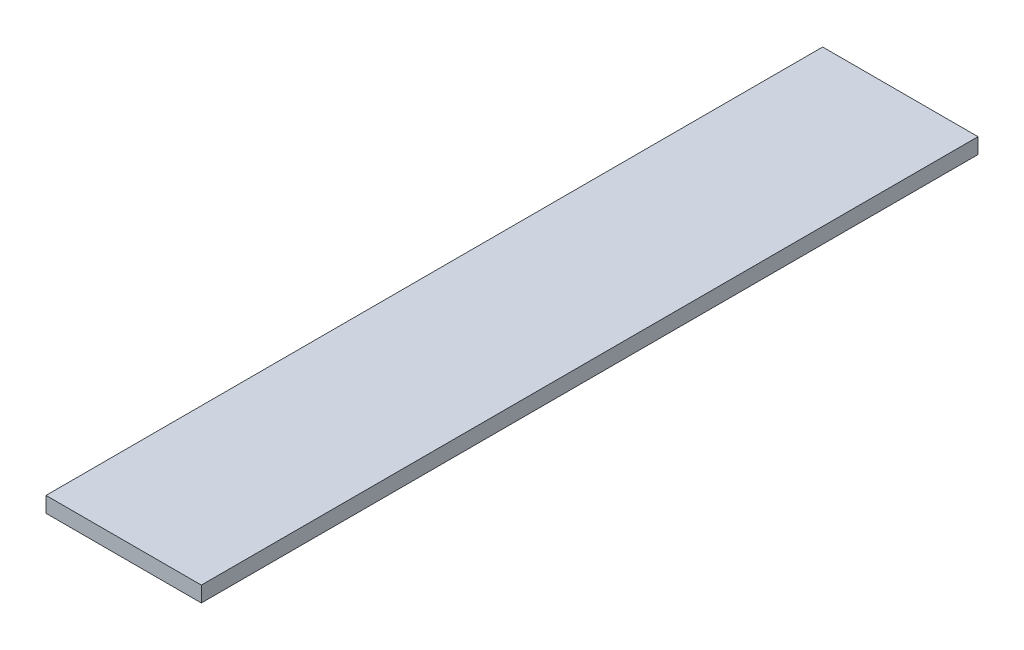
ISO-10303-21;
HEADER;
FILE_DESCRIPTION(('STEP AP214'),'2;1');
FILE_NAME('part.step','',(''),(''),'','','');
FILE_SCHEMA(('AUTOMOTIVE_DESIGN { 1 0 10303 214 1 1 1 1 }'));
ENDSEC;
DATA;
#1=APPLICATION_CONTEXT('core data for automotive mechanical design processes');
#2=APPLICATION_PROTOCOL_DEFINITION('international standard','automotive_design',2000,#1);
#3=PRODUCT_CONTEXT('',#1,'mechanical');
#4=PRODUCT('Part','Part','',(#3));
#5=PRODUCT_RELATED_PRODUCT_CATEGORY('part','',(#4));
#6=PRODUCT_DEFINITION_FORMATION('','',#4);
#7=PRODUCT_DEFINITION_CONTEXT('part definition',#1,'design');
#8=PRODUCT_DEFINITION('design','',#6,#7);
#9=PRODUCT_DEFINITION_SHAPE('','',#8);
#10=(LENGTH_UNIT() NAMED_UNIT(*) SI_UNIT(.MILLI.,.METRE.));
#11=(NAMED_UNIT(*) PLANE_ANGLE_UNIT() SI_UNIT($,.RADIAN.));
#12=(NAMED_UNIT(*) SI_UNIT($,.STERADIAN.) SOLID_ANGLE_UNIT());
#13=UNCERTAINTY_MEASURE_WITH_UNIT(LENGTH_MEASURE(1.E-05),#10,'distance_accuracy_value','');
#14=(GEOMETRIC_REPRESENTATION_CONTEXT(3) GLOBAL_UNCERTAINTY_ASSIGNED_CONTEXT((#13)) GLOBAL_UNIT_ASSIGNED_CONTEXT((#10,
#11,#12)) REPRESENTATION_CONTEXT('',''));
#15=CARTESIAN_POINT('',(0.,0.,0.));
#16=DIRECTION('',(0.,0.,1.));
#17=DIRECTION('',(1.,0.,0.));
#18=AXIS2_PLACEMENT_3D('',#15,#16,#17);
#19=CARTESIAN_POINT('',(0.,20.,0.));
#20=DIRECTION('',(1.,0.,0.));
#21=DIRECTION('',(0.,0.,-1.));
#22=AXIS2_PLACEMENT_3D('',#19,#20,#21);
#23=PLANE('',#22);
#24=DIRECTION('',(0.,0.,1.));
#25=VECTOR('',#24,1.);
#26=CARTESIAN_POINT('',(0.,0.,0.));
#27=LINE('',#26,#25);
#28=CARTESIAN_POINT('',(0.,0.,-1000.));
#29=VERTEX_POINT('',#28);
#30=CARTESIAN_POINT('',(0.,0.,0.));
#31=VERTEX_POINT('',#30);
#32=EDGE_CURVE('E96',#29,#31,#27,.T.);
#33=ORIENTED_EDGE('',*,*,#32,.T.);
#34=DIRECTION('',(0.,-1.,0.));
#35=VECTOR('',#34,1.);
#36=CARTESIAN_POINT('',(0.,20.,0.));
#37=LINE('',#36,#35);
#38=CARTESIAN_POINT('',(0.,20.,0.));
#39=VERTEX_POINT('',#38);
#40=EDGE_CURVE('E11',#39,#31,#37,.T.);
#41=ORIENTED_EDGE('',*,*,#40,.F.);
#42=DIRECTION('',(0.,0.,1.));
#43=VECTOR('',#42,1.);
#44=CARTESIAN_POINT('',(0.,20.,0.));
#45=LINE('',#44,#43);
#46=CARTESIAN_POINT('',(0.,20.,-1000.));
#47=VERTEX_POINT('',#46);
#48=EDGE_CURVE('E84',#47,#39,#45,.T.);
#49=ORIENTED_EDGE('',*,*,#48,.F.);
#50=DIRECTION('',(0.,-1.,0.));
#51=VECTOR('',#50,1.);
#52=CARTESIAN_POINT('',(0.,20.,-1000.));
#53=LINE('',#52,#51);
#54=EDGE_CURVE('E92',#47,#29,#53,.T.);
#55=ORIENTED_EDGE('',*,*,#54,.T.);
#56=EDGE_LOOP('',(#33,#41,#49,#55));
#57=FACE_BOUND('',#56,.T.);
#58=ADVANCED_FACE('F33',(#57),#23,.F.);
#59=CARTESIAN_POINT('',(0.,20.,0.));
#60=DIRECTION('',(0.,0.,-1.));
#61=DIRECTION('',(-1.,0.,0.));
#62=AXIS2_PLACEMENT_3D('',#59,#60,#61);
#63=PLANE('',#62);
#64=DIRECTION('',(1.,0.,0.));
#65=VECTOR('',#64,1.);
#66=CARTESIAN_POINT('',(0.,0.,0.));
#67=LINE('',#66,#65);
#68=CARTESIAN_POINT('',(200.,0.,0.));
#69=VERTEX_POINT('',#68);
#70=EDGE_CURVE('E88',#31,#69,#67,.T.);
#71=ORIENTED_EDGE('',*,*,#70,.T.);
#72=DIRECTION('',(0.,-1.,0.));
#73=VECTOR('',#72,1.);
#74=CARTESIAN_POINT('',(200.,20.,0.));
#75=LINE('',#74,#73);
#76=CARTESIAN_POINT('',(200.,20.,0.));
#77=VERTEX_POINT('',#76);
#78=EDGE_CURVE('E41',#77,#69,#75,.T.);
#79=ORIENTED_EDGE('',*,*,#78,.F.);
#80=DIRECTION('',(1.,0.,0.));
#81=VECTOR('',#80,1.);
#82=CARTESIAN_POINT('',(0.,20.,0.));
#83=LINE('',#82,#81);
#84=EDGE_CURVE('E79',#39,#77,#83,.T.);
#85=ORIENTED_EDGE('',*,*,#84,.F.);
#86=ORIENTED_EDGE('',*,*,#40,.T.);
#87=EDGE_LOOP('',(#71,#79,#85,#86));
#88=FACE_BOUND('',#87,.T.);
#89=ADVANCED_FACE('F87',(#88),#63,.F.);
#90=CARTESIAN_POINT('',(200.,20.,0.));
#91=DIRECTION('',(-1.,0.,0.));
#92=DIRECTION('',(0.,0.,1.));
#93=AXIS2_PLACEMENT_3D('',#90,#91,#92);
#94=PLANE('',#93);
#95=DIRECTION('',(0.,0.,-1.));
#96=VECTOR('',#95,1.);
#97=CARTESIAN_POINT('',(200.,0.,0.));
#98=LINE('',#97,#96);
#99=CARTESIAN_POINT('',(200.,0.,-1000.));
#100=VERTEX_POINT('',#99);
#101=EDGE_CURVE('E66',#69,#100,#98,.T.);
#102=ORIENTED_EDGE('',*,*,#101,.T.);
#103=DIRECTION('',(0.,-1.,0.));
#104=VECTOR('',#103,1.);
#105=CARTESIAN_POINT('',(200.,20.,-1000.));
#106=LINE('',#105,#104);
#107=CARTESIAN_POINT('',(200.,20.,-1000.));
#108=VERTEX_POINT('',#107);
#109=EDGE_CURVE('E89',#108,#100,#106,.T.);
#110=ORIENTED_EDGE('',*,*,#109,.F.);
#111=DIRECTION('',(0.,0.,-1.));
#112=VECTOR('',#111,1.);
#113=CARTESIAN_POINT('',(200.,20.,0.));
#114=LINE('',#113,#112);
#115=EDGE_CURVE('E82',#77,#108,#114,.T.);
#116=ORIENTED_EDGE('',*,*,#115,.F.);
#117=ORIENTED_EDGE('',*,*,#78,.T.);
#118=EDGE_LOOP('',(#102,#110,#116,#117));
#119=FACE_BOUND('',#118,.T.);
#120=ADVANCED_FACE('F90',(#119),#94,.F.);
#121=CARTESIAN_POINT('',(0.,20.,-1000.));
#122=DIRECTION('',(0.,0.,1.));
#123=DIRECTION('',(1.,0.,0.));
#124=AXIS2_PLACEMENT_3D('',#121,#122,#123);
#125=PLANE('',#124);
#126=DIRECTION('',(-1.,0.,0.));
#127=VECTOR('',#126,1.);
#128=CARTESIAN_POINT('',(0.,0.,-1000.));
#129=LINE('',#128,#127);
#130=EDGE_CURVE('E72',#100,#29,#129,.T.);
#131=ORIENTED_EDGE('',*,*,#130,.T.);
#132=ORIENTED_EDGE('',*,*,#54,.F.);
#133=DIRECTION('',(-1.,0.,0.));
#134=VECTOR('',#133,1.);
#135=CARTESIAN_POINT('',(0.,20.,-1000.));
#136=LINE('',#135,#134);
#137=EDGE_CURVE('E49',#108,#47,#136,.T.);
#138=ORIENTED_EDGE('',*,*,#137,.F.);
#139=ORIENTED_EDGE('',*,*,#109,.T.);
#140=EDGE_LOOP('',(#131,#132,#138,#139));
#141=FACE_BOUND('',#140,.T.);
#142=ADVANCED_FACE('F103',(#141),#125,.F.);
#143=CARTESIAN_POINT('',(0.,20.,0.));
#144=DIRECTION('',(0.,-1.,0.));
#145=DIRECTION('',(0.,0.,-1.));
#146=AXIS2_PLACEMENT_3D('',#143,#144,#145);
#147=PLANE('',#146);
#148=ORIENTED_EDGE('',*,*,#48,.T.);
#149=ORIENTED_EDGE('',*,*,#84,.T.);
#150=ORIENTED_EDGE('',*,*,#115,.T.);
#151=ORIENTED_EDGE('',*,*,#137,.T.);
#152=EDGE_LOOP('',(#148,#149,#150,#151));
#153=FACE_BOUND('',#152,.T.);
#154=ADVANCED_FACE('F80',(#153),#147,.F.);
#155=CARTESIAN_POINT('',(0.,0.,0.));
#156=DIRECTION('',(0.,-1.,0.));
#157=DIRECTION('',(0.,0.,-1.));
#158=AXIS2_PLACEMENT_3D('',#155,#156,#157);
#159=PLANE('',#158);
#160=ORIENTED_EDGE('',*,*,#32,.F.);
#161=ORIENTED_EDGE('',*,*,#130,.F.);
#162=ORIENTED_EDGE('',*,*,#101,.F.);
#163=ORIENTED_EDGE('',*,*,#70,.F.);
#164=EDGE_LOOP('',(#160,#161,#162,#163));
#165=FACE_BOUND('',#164,.T.);
#166=ADVANCED_FACE('F106',(#165),#159,.T.);
#167=CLOSED_SHELL('',(#58,#89,#120,#142,#154,#166));
#168=MANIFOLD_SOLID_BREP('B2',#167);
#169=ADVANCED_BREP_SHAPE_REPRESENTATION('',(#18,#168),#14);
#170=SHAPE_DEFINITION_REPRESENTATION(#9,#169);
ENDSEC;
END-ISO-10303-21;
